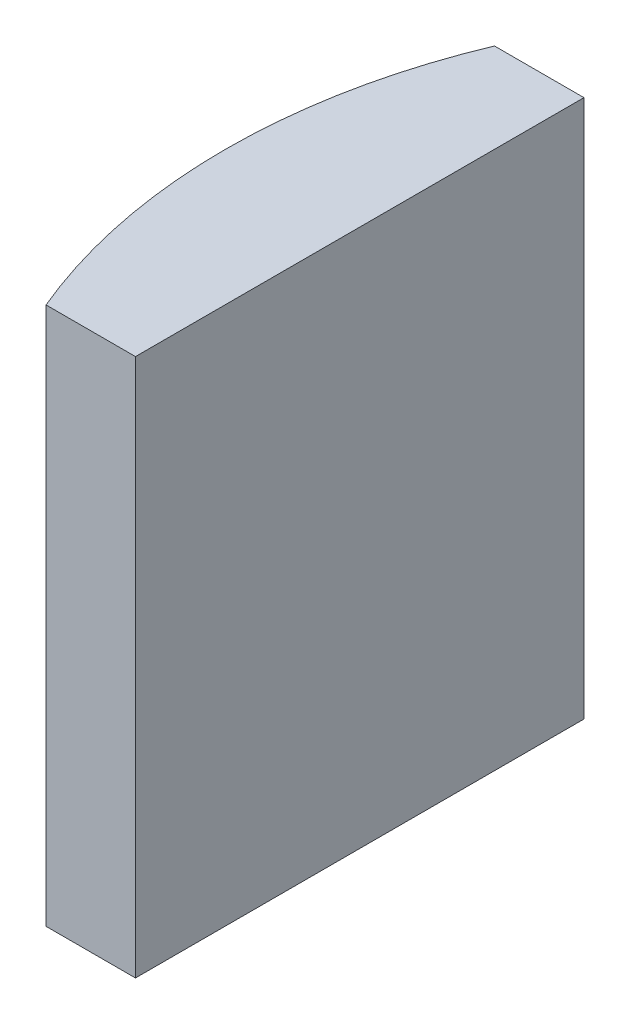
ISO-10303-21;
HEADER;
FILE_DESCRIPTION(('STEP AP214'),'2;1');
FILE_NAME('part.step','',(''),(''),'','','');
FILE_SCHEMA(('AUTOMOTIVE_DESIGN { 1 0 10303 214 1 1 1 1 }'));
ENDSEC;
DATA;
#1=APPLICATION_CONTEXT('core data for automotive mechanical design processes');
#2=APPLICATION_PROTOCOL_DEFINITION('international standard','automotive_design',2000,#1);
#3=PRODUCT_CONTEXT('',#1,'mechanical');
#4=PRODUCT('Part','Part','',(#3));
#5=PRODUCT_RELATED_PRODUCT_CATEGORY('part','',(#4));
#6=PRODUCT_DEFINITION_FORMATION('','',#4);
#7=PRODUCT_DEFINITION_CONTEXT('part definition',#1,'design');
#8=PRODUCT_DEFINITION('design','',#6,#7);
#9=PRODUCT_DEFINITION_SHAPE('','',#8);
#10=(LENGTH_UNIT() NAMED_UNIT(*) SI_UNIT(.MILLI.,.METRE.));
#11=(NAMED_UNIT(*) PLANE_ANGLE_UNIT() SI_UNIT($,.RADIAN.));
#12=(NAMED_UNIT(*) SI_UNIT($,.STERADIAN.) SOLID_ANGLE_UNIT());
#13=UNCERTAINTY_MEASURE_WITH_UNIT(LENGTH_MEASURE(1.E-05),#10,'distance_accuracy_value','');
#14=(GEOMETRIC_REPRESENTATION_CONTEXT(3) GLOBAL_UNCERTAINTY_ASSIGNED_CONTEXT((#13)) GLOBAL_UNIT_ASSIGNED_CONTEXT((#10,
#11,#12)) REPRESENTATION_CONTEXT('',''));
#15=CARTESIAN_POINT('',(0.,0.,0.));
#16=DIRECTION('',(0.,0.,1.));
#17=DIRECTION('',(1.,0.,0.));
#18=AXIS2_PLACEMENT_3D('',#15,#16,#17);
#19=CARTESIAN_POINT('',(4.35520433485127,12.,0.));
#20=DIRECTION('',(0.,-1.,0.));
#21=DIRECTION('',(0.,0.,-1.));
#22=AXIS2_PLACEMENT_3D('',#19,#20,#21);
#23=CYLINDRICAL_SURFACE('',#22,12.93);
#24=CARTESIAN_POINT('',(4.35520433485127,0.,0.));
#25=DIRECTION('',(0.,1.,0.));
#26=DIRECTION('',(0.,0.,1.));
#27=AXIS2_PLACEMENT_3D('',#24,#25,#26);
#28=CIRCLE('',#27,12.93);
#29=CARTESIAN_POINT('',(-7.56892666073915,0.,-5.));
#30=VERTEX_POINT('',#29);
#31=CARTESIAN_POINT('',(-7.56892666073915,0.,5.));
#32=VERTEX_POINT('',#31);
#33=EDGE_CURVE('E100',#30,#32,#28,.T.);
#34=ORIENTED_EDGE('',*,*,#33,.T.);
#35=DIRECTION('',(0.,-1.,0.));
#36=VECTOR('',#35,1.);
#37=CARTESIAN_POINT('',(-7.56892666073915,12.,5.));
#38=LINE('',#37,#36);
#39=CARTESIAN_POINT('',(-7.56892666073915,12.,5.));
#40=VERTEX_POINT('',#39);
#41=EDGE_CURVE('E11',#40,#32,#38,.T.);
#42=ORIENTED_EDGE('',*,*,#41,.F.);
#43=CARTESIAN_POINT('',(4.35520433485127,12.,0.));
#44=DIRECTION('',(0.,1.,0.));
#45=DIRECTION('',(0.,0.,1.));
#46=AXIS2_PLACEMENT_3D('',#43,#44,#45);
#47=CIRCLE('',#46,12.93);
#48=CARTESIAN_POINT('',(-7.56892666073915,12.,-5.));
#49=VERTEX_POINT('',#48);
#50=EDGE_CURVE('E88',#49,#40,#47,.T.);
#51=ORIENTED_EDGE('',*,*,#50,.F.);
#52=DIRECTION('',(0.,-1.,0.));
#53=VECTOR('',#52,1.);
#54=CARTESIAN_POINT('',(-7.56892666073915,12.,-5.));
#55=LINE('',#54,#53);
#56=EDGE_CURVE('E96',#49,#30,#55,.T.);
#57=ORIENTED_EDGE('',*,*,#56,.T.);
#58=EDGE_LOOP('',(#34,#42,#51,#57));
#59=FACE_BOUND('',#58,.T.);
#60=ADVANCED_FACE('F37',(#59),#23,.T.);
#61=CARTESIAN_POINT('',(-7.56892666073915,12.,5.));
#62=DIRECTION('',(0.,0.,-1.));
#63=DIRECTION('',(-1.,0.,0.));
#64=AXIS2_PLACEMENT_3D('',#61,#62,#63);
#65=PLANE('',#64);
#66=DIRECTION('',(1.,0.,0.));
#67=VECTOR('',#66,1.);
#68=CARTESIAN_POINT('',(-7.56892666073915,0.,5.));
#69=LINE('',#68,#67);
#70=CARTESIAN_POINT('',(-5.57479566514873,0.,5.));
#71=VERTEX_POINT('',#70);
#72=EDGE_CURVE('E92',#32,#71,#69,.T.);
#73=ORIENTED_EDGE('',*,*,#72,.T.);
#74=DIRECTION('',(0.,-1.,0.));
#75=VECTOR('',#74,1.);
#76=CARTESIAN_POINT('',(-5.57479566514873,12.,5.));
#77=LINE('',#76,#75);
#78=CARTESIAN_POINT('',(-5.57479566514873,12.,5.));
#79=VERTEX_POINT('',#78);
#80=EDGE_CURVE('E45',#79,#71,#77,.T.);
#81=ORIENTED_EDGE('',*,*,#80,.F.);
#82=DIRECTION('',(1.,0.,0.));
#83=VECTOR('',#82,1.);
#84=CARTESIAN_POINT('',(-7.56892666073915,12.,5.));
#85=LINE('',#84,#83);
#86=EDGE_CURVE('E83',#40,#79,#85,.T.);
#87=ORIENTED_EDGE('',*,*,#86,.F.);
#88=ORIENTED_EDGE('',*,*,#41,.T.);
#89=EDGE_LOOP('',(#73,#81,#87,#88));
#90=FACE_BOUND('',#89,.T.);
#91=ADVANCED_FACE('F91',(#90),#65,.F.);
#92=CARTESIAN_POINT('',(-5.57479566514874,12.,-5.));
#93=DIRECTION('',(-1.,0.,0.));
#94=DIRECTION('',(0.,0.,1.));
#95=AXIS2_PLACEMENT_3D('',#92,#93,#94);
#96=PLANE('',#95);
#97=DIRECTION('',(0.,0.,-1.));
#98=VECTOR('',#97,1.);
#99=CARTESIAN_POINT('',(-5.57479566514874,0.,-5.));
#100=LINE('',#99,#98);
#101=CARTESIAN_POINT('',(-5.57479566514874,0.,-5.));
#102=VERTEX_POINT('',#101);
#103=EDGE_CURVE('E70',#71,#102,#100,.T.);
#104=ORIENTED_EDGE('',*,*,#103,.T.);
#105=DIRECTION('',(0.,-1.,0.));
#106=VECTOR('',#105,1.);
#107=CARTESIAN_POINT('',(-5.57479566514874,12.,-5.));
#108=LINE('',#107,#106);
#109=CARTESIAN_POINT('',(-5.57479566514874,12.,-5.));
#110=VERTEX_POINT('',#109);
#111=EDGE_CURVE('E93',#110,#102,#108,.T.);
#112=ORIENTED_EDGE('',*,*,#111,.F.);
#113=DIRECTION('',(0.,0.,-1.));
#114=VECTOR('',#113,1.);
#115=CARTESIAN_POINT('',(-5.57479566514874,12.,-5.));
#116=LINE('',#115,#114);
#117=EDGE_CURVE('E86',#79,#110,#116,.T.);
#118=ORIENTED_EDGE('',*,*,#117,.F.);
#119=ORIENTED_EDGE('',*,*,#80,.T.);
#120=EDGE_LOOP('',(#104,#112,#118,#119));
#121=FACE_BOUND('',#120,.T.);
#122=ADVANCED_FACE('F94',(#121),#96,.F.);
#123=CARTESIAN_POINT('',(-7.56892666073915,12.,-5.));
#124=DIRECTION('',(0.,0.,1.));
#125=DIRECTION('',(1.,0.,0.));
#126=AXIS2_PLACEMENT_3D('',#123,#124,#125);
#127=PLANE('',#126);
#128=DIRECTION('',(-1.,0.,0.));
#129=VECTOR('',#128,1.);
#130=CARTESIAN_POINT('',(-7.56892666073915,0.,-5.));
#131=LINE('',#130,#129);
#132=EDGE_CURVE('E76',#102,#30,#131,.T.);
#133=ORIENTED_EDGE('',*,*,#132,.T.);
#134=ORIENTED_EDGE('',*,*,#56,.F.);
#135=DIRECTION('',(-1.,0.,0.));
#136=VECTOR('',#135,1.);
#137=CARTESIAN_POINT('',(-7.56892666073915,12.,-5.));
#138=LINE('',#137,#136);
#139=EDGE_CURVE('E53',#110,#49,#138,.T.);
#140=ORIENTED_EDGE('',*,*,#139,.F.);
#141=ORIENTED_EDGE('',*,*,#111,.T.);
#142=EDGE_LOOP('',(#133,#134,#140,#141));
#143=FACE_BOUND('',#142,.T.);
#144=ADVANCED_FACE('F107',(#143),#127,.F.);
#145=CARTESIAN_POINT('',(4.35520433485127,12.,0.));
#146=DIRECTION('',(0.,1.,0.));
#147=DIRECTION('',(0.,0.,1.));
#148=AXIS2_PLACEMENT_3D('',#145,#146,#147);
#149=PLANE('',#148);
#150=ORIENTED_EDGE('',*,*,#50,.T.);
#151=ORIENTED_EDGE('',*,*,#86,.T.);
#152=ORIENTED_EDGE('',*,*,#117,.T.);
#153=ORIENTED_EDGE('',*,*,#139,.T.);
#154=EDGE_LOOP('',(#150,#151,#152,#153));
#155=FACE_BOUND('',#154,.T.);
#156=ADVANCED_FACE('F84',(#155),#149,.T.);
#157=CARTESIAN_POINT('',(4.35520433485127,0.,0.));
#158=DIRECTION('',(0.,1.,0.));
#159=DIRECTION('',(0.,0.,1.));
#160=AXIS2_PLACEMENT_3D('',#157,#158,#159);
#161=PLANE('',#160);
#162=ORIENTED_EDGE('',*,*,#33,.F.);
#163=ORIENTED_EDGE('',*,*,#132,.F.);
#164=ORIENTED_EDGE('',*,*,#103,.F.);
#165=ORIENTED_EDGE('',*,*,#72,.F.);
#166=EDGE_LOOP('',(#162,#163,#164,#165));
#167=FACE_BOUND('',#166,.T.);
#168=ADVANCED_FACE('F110',(#167),#161,.F.);
#169=CLOSED_SHELL('',(#60,#91,#122,#144,#156,#168));
#170=MANIFOLD_SOLID_BREP('B2',#169);
#171=ADVANCED_BREP_SHAPE_REPRESENTATION('',(#18,#170),#14);
#172=SHAPE_DEFINITION_REPRESENTATION(#9,#171);
ENDSEC;
END-ISO-10303-21;
